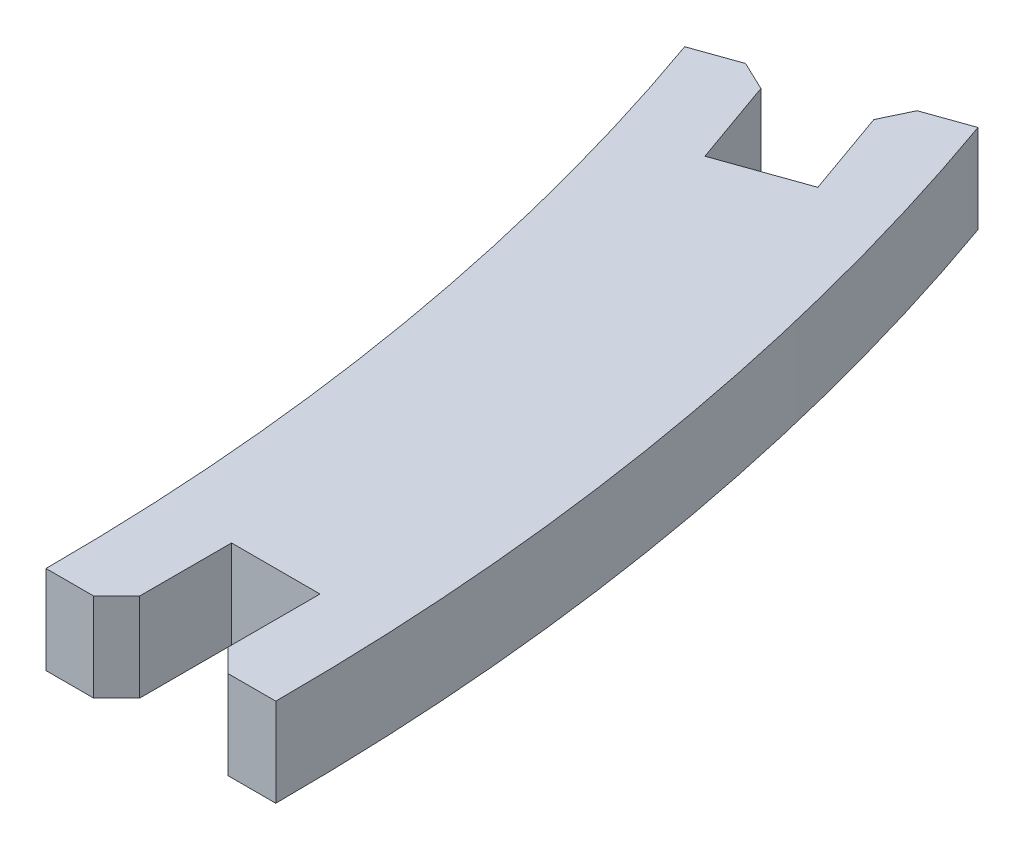
ISO-10303-21;
HEADER;
FILE_DESCRIPTION(('STEP AP214'),'2;1');
FILE_NAME('part.step','',(''),(''),'','','');
FILE_SCHEMA(('AUTOMOTIVE_DESIGN { 1 0 10303 214 1 1 1 1 }'));
ENDSEC;
DATA;
#1=APPLICATION_CONTEXT('core data for automotive mechanical design processes');
#2=APPLICATION_PROTOCOL_DEFINITION('international standard','automotive_design',2000,#1);
#3=PRODUCT_CONTEXT('',#1,'mechanical');
#4=PRODUCT('Part','Part','',(#3));
#5=PRODUCT_RELATED_PRODUCT_CATEGORY('part','',(#4));
#6=PRODUCT_DEFINITION_FORMATION('','',#4);
#7=PRODUCT_DEFINITION_CONTEXT('part definition',#1,'design');
#8=PRODUCT_DEFINITION('design','',#6,#7);
#9=PRODUCT_DEFINITION_SHAPE('','',#8);
#10=(LENGTH_UNIT() NAMED_UNIT(*) SI_UNIT(.MILLI.,.METRE.));
#11=(NAMED_UNIT(*) PLANE_ANGLE_UNIT() SI_UNIT($,.RADIAN.));
#12=(NAMED_UNIT(*) SI_UNIT($,.STERADIAN.) SOLID_ANGLE_UNIT());
#13=UNCERTAINTY_MEASURE_WITH_UNIT(LENGTH_MEASURE(1.E-05),#10,'distance_accuracy_value','');
#14=(GEOMETRIC_REPRESENTATION_CONTEXT(3) GLOBAL_UNCERTAINTY_ASSIGNED_CONTEXT((#13)) GLOBAL_UNIT_ASSIGNED_CONTEXT((#10,
#11,#12)) REPRESENTATION_CONTEXT('',''));
#15=CARTESIAN_POINT('',(0.,0.,0.));
#16=DIRECTION('',(0.,0.,1.));
#17=DIRECTION('',(1.,0.,0.));
#18=AXIS2_PLACEMENT_3D('',#15,#16,#17);
#19=CARTESIAN_POINT('',(-11.876973594274,3.85,0.165793148252615));
#20=DIRECTION('',(0.,0.,-1.));
#21=DIRECTION('',(-1.,0.,0.));
#22=AXIS2_PLACEMENT_3D('',#19,#20,#21);
#23=PLANE('',#22);
#24=DIRECTION('',(1.,0.,0.));
#25=VECTOR('',#24,1.);
#26=CARTESIAN_POINT('',(-11.876973594274,0.,0.165793148252615));
#27=LINE('',#26,#25);
#28=CARTESIAN_POINT('',(-11.876973594274,0.,0.165793148252621));
#29=VERTEX_POINT('',#28);
#30=CARTESIAN_POINT('',(-9.80197359427399,0.,0.165793148252615));
#31=VERTEX_POINT('',#30);
#32=EDGE_CURVE('E199',#29,#31,#27,.T.);
#33=ORIENTED_EDGE('',*,*,#32,.T.);
#34=DIRECTION('',(0.,1.,0.));
#35=VECTOR('',#34,1.);
#36=CARTESIAN_POINT('',(-9.80197359427399,3.85,0.165793148252615));
#37=LINE('',#36,#35);
#38=CARTESIAN_POINT('',(-9.80197359427399,3.85,0.165793148252615));
#39=VERTEX_POINT('',#38);
#40=EDGE_CURVE('E252',#31,#39,#37,.T.);
#41=ORIENTED_EDGE('',*,*,#40,.T.);
#42=DIRECTION('',(1.,0.,0.));
#43=VECTOR('',#42,1.);
#44=CARTESIAN_POINT('',(-11.876973594274,3.85,0.165793148252615));
#45=LINE('',#44,#43);
#46=CARTESIAN_POINT('',(-11.876973594274,3.85,0.165793148252621));
#47=VERTEX_POINT('',#46);
#48=EDGE_CURVE('E158',#47,#39,#45,.T.);
#49=ORIENTED_EDGE('',*,*,#48,.F.);
#50=DIRECTION('',(0.,-1.,0.));
#51=VECTOR('',#50,1.);
#52=CARTESIAN_POINT('',(-11.876973594274,3.85,0.165793148252621));
#53=LINE('',#52,#51);
#54=EDGE_CURVE('E198',#47,#29,#53,.T.);
#55=ORIENTED_EDGE('',*,*,#54,.T.);
#56=EDGE_LOOP('',(#33,#41,#49,#55));
#57=FACE_BOUND('',#56,.T.);
#58=ADVANCED_FACE('F33',(#57),#23,.F.);
#59=CARTESIAN_POINT('',(-8.80197359427398,3.85,0.165793148252615));
#60=DIRECTION('',(-1.,0.,0.));
#61=DIRECTION('',(0.,0.,1.));
#62=AXIS2_PLACEMENT_3D('',#59,#60,#61);
#63=PLANE('',#62);
#64=DIRECTION('',(0.,0.,-1.));
#65=VECTOR('',#64,1.);
#66=CARTESIAN_POINT('',(-8.80197359427398,3.85,0.165793148252615));
#67=LINE('',#66,#65);
#68=CARTESIAN_POINT('',(-8.80197359427398,3.85,-0.834206851747385));
#69=VERTEX_POINT('',#68);
#70=CARTESIAN_POINT('',(-8.80197359427398,3.85,-4.83420685174738));
#71=VERTEX_POINT('',#70);
#72=EDGE_CURVE('E146',#69,#71,#67,.T.);
#73=ORIENTED_EDGE('',*,*,#72,.F.);
#74=DIRECTION('',(0.,-1.,0.));
#75=VECTOR('',#74,1.);
#76=CARTESIAN_POINT('',(-8.80197359427398,3.85,-0.834206851747385));
#77=LINE('',#76,#75);
#78=CARTESIAN_POINT('',(-8.80197359427398,0.,-0.834206851747385));
#79=VERTEX_POINT('',#78);
#80=EDGE_CURVE('E168',#69,#79,#77,.T.);
#81=ORIENTED_EDGE('',*,*,#80,.T.);
#82=DIRECTION('',(0.,0.,-1.));
#83=VECTOR('',#82,1.);
#84=CARTESIAN_POINT('',(-8.80197359427398,0.,0.165793148252615));
#85=LINE('',#84,#83);
#86=CARTESIAN_POINT('',(-8.80197359427398,0.,-4.83420685174738));
#87=VERTEX_POINT('',#86);
#88=EDGE_CURVE('E164',#79,#87,#85,.T.);
#89=ORIENTED_EDGE('',*,*,#88,.T.);
#90=DIRECTION('',(0.,-1.,0.));
#91=VECTOR('',#90,1.);
#92=CARTESIAN_POINT('',(-8.80197359427398,3.85,-4.83420685174738));
#93=LINE('',#92,#91);
#94=EDGE_CURVE('E161',#71,#87,#93,.T.);
#95=ORIENTED_EDGE('',*,*,#94,.F.);
#96=EDGE_LOOP('',(#73,#81,#89,#95));
#97=FACE_BOUND('',#96,.T.);
#98=ADVANCED_FACE('F162',(#97),#63,.F.);
#99=CARTESIAN_POINT('',(-4.95197359427398,3.85,-4.83420685174738));
#100=DIRECTION('',(0.,0.,1.));
#101=DIRECTION('',(1.,0.,0.));
#102=AXIS2_PLACEMENT_3D('',#99,#100,#101);
#103=PLANE('',#102);
#104=DIRECTION('',(-1.,0.,0.));
#105=VECTOR('',#104,1.);
#106=CARTESIAN_POINT('',(-4.95197359427398,0.,-4.83420685174738));
#107=LINE('',#106,#105);
#108=CARTESIAN_POINT('',(-4.95197359427398,0.,-4.83420685174738));
#109=VERTEX_POINT('',#108);
#110=EDGE_CURVE('E203',#109,#87,#107,.T.);
#111=ORIENTED_EDGE('',*,*,#110,.F.);
#112=DIRECTION('',(0.,-1.,0.));
#113=VECTOR('',#112,1.);
#114=CARTESIAN_POINT('',(-4.95197359427398,3.85,-4.83420685174738));
#115=LINE('',#114,#113);
#116=CARTESIAN_POINT('',(-4.95197359427398,3.85,-4.83420685174738));
#117=VERTEX_POINT('',#116);
#118=EDGE_CURVE('E169',#117,#109,#115,.T.);
#119=ORIENTED_EDGE('',*,*,#118,.F.);
#120=DIRECTION('',(-1.,0.,0.));
#121=VECTOR('',#120,1.);
#122=CARTESIAN_POINT('',(-4.95197359427398,3.85,-4.83420685174738));
#123=LINE('',#122,#121);
#124=EDGE_CURVE('E152',#117,#71,#123,.T.);
#125=ORIENTED_EDGE('',*,*,#124,.T.);
#126=ORIENTED_EDGE('',*,*,#94,.T.);
#127=EDGE_LOOP('',(#111,#119,#125,#126));
#128=FACE_BOUND('',#127,.T.);
#129=ADVANCED_FACE('F172',(#128),#103,.T.);
#130=CARTESIAN_POINT('',(-4.95197359427398,3.85,0.165793148252615));
#131=DIRECTION('',(-1.,0.,0.));
#132=DIRECTION('',(0.,0.,1.));
#133=AXIS2_PLACEMENT_3D('',#130,#131,#132);
#134=PLANE('',#133);
#135=DIRECTION('',(0.,0.,-1.));
#136=VECTOR('',#135,1.);
#137=CARTESIAN_POINT('',(-4.95197359427398,0.,0.165793148252615));
#138=LINE('',#137,#136);
#139=CARTESIAN_POINT('',(-4.95197359427398,0.,-0.834206851747392));
#140=VERTEX_POINT('',#139);
#141=EDGE_CURVE('E205',#140,#109,#138,.T.);
#142=ORIENTED_EDGE('',*,*,#141,.F.);
#143=DIRECTION('',(0.,1.,0.));
#144=VECTOR('',#143,1.);
#145=CARTESIAN_POINT('',(-4.95197359427398,3.85,-0.834206851747392));
#146=LINE('',#145,#144);
#147=CARTESIAN_POINT('',(-4.95197359427398,3.85,-0.834206851747392));
#148=VERTEX_POINT('',#147);
#149=EDGE_CURVE('E263',#140,#148,#146,.T.);
#150=ORIENTED_EDGE('',*,*,#149,.T.);
#151=DIRECTION('',(0.,0.,-1.));
#152=VECTOR('',#151,1.);
#153=CARTESIAN_POINT('',(-4.95197359427398,3.85,0.165793148252615));
#154=LINE('',#153,#152);
#155=EDGE_CURVE('E174',#148,#117,#154,.T.);
#156=ORIENTED_EDGE('',*,*,#155,.T.);
#157=ORIENTED_EDGE('',*,*,#118,.T.);
#158=EDGE_LOOP('',(#142,#150,#156,#157));
#159=FACE_BOUND('',#158,.T.);
#160=ADVANCED_FACE('F306',(#159),#134,.T.);
#161=CARTESIAN_POINT('',(-4.95197359427398,3.85,0.165793148252615));
#162=DIRECTION('',(0.,0.,-1.));
#163=DIRECTION('',(-1.,0.,0.));
#164=AXIS2_PLACEMENT_3D('',#161,#162,#163);
#165=PLANE('',#164);
#166=DIRECTION('',(1.,0.,0.));
#167=VECTOR('',#166,1.);
#168=CARTESIAN_POINT('',(-4.95197359427398,3.85,0.165793148252615));
#169=LINE('',#168,#167);
#170=CARTESIAN_POINT('',(-3.95197359427398,3.85,0.165793148252615));
#171=VERTEX_POINT('',#170);
#172=CARTESIAN_POINT('',(-1.87697359427398,3.85,0.165793148252615));
#173=VERTEX_POINT('',#172);
#174=EDGE_CURVE('E176',#171,#173,#169,.T.);
#175=ORIENTED_EDGE('',*,*,#174,.F.);
#176=DIRECTION('',(0.,-1.,0.));
#177=VECTOR('',#176,1.);
#178=CARTESIAN_POINT('',(-3.95197359427398,0.,0.165793148252615));
#179=LINE('',#178,#177);
#180=CARTESIAN_POINT('',(-3.95197359427398,0.,0.165793148252615));
#181=VERTEX_POINT('',#180);
#182=EDGE_CURVE('E260',#171,#181,#179,.T.);
#183=ORIENTED_EDGE('',*,*,#182,.T.);
#184=DIRECTION('',(1.,0.,0.));
#185=VECTOR('',#184,1.);
#186=CARTESIAN_POINT('',(-4.95197359427398,0.,0.165793148252615));
#187=LINE('',#186,#185);
#188=CARTESIAN_POINT('',(-1.87697359427398,0.,0.165793148252615));
#189=VERTEX_POINT('',#188);
#190=EDGE_CURVE('E207',#181,#189,#187,.T.);
#191=ORIENTED_EDGE('',*,*,#190,.T.);
#192=DIRECTION('',(0.,-1.,0.));
#193=VECTOR('',#192,1.);
#194=CARTESIAN_POINT('',(-1.87697359427398,3.85,0.165793148252615));
#195=LINE('',#194,#193);
#196=EDGE_CURVE('E239',#173,#189,#195,.T.);
#197=ORIENTED_EDGE('',*,*,#196,.F.);
#198=EDGE_LOOP('',(#175,#183,#191,#197));
#199=FACE_BOUND('',#198,.T.);
#200=ADVANCED_FACE('F298',(#199),#165,.F.);
#201=CARTESIAN_POINT('',(-112.422199310062,3.85,0.165793148252615));
#202=DIRECTION('',(0.,-1.,0.));
#203=DIRECTION('',(0.,0.,-1.));
#204=AXIS2_PLACEMENT_3D('',#201,#202,#203);
#205=CYLINDRICAL_SURFACE('',#204,110.545225715788);
#206=CARTESIAN_POINT('',(-112.422199310062,0.,0.165793148252615));
#207=DIRECTION('',(0.,1.,0.));
#208=DIRECTION('',(0.,0.,1.));
#209=AXIS2_PLACEMENT_3D('',#206,#207,#208);
#210=CIRCLE('',#209,110.545225715788);
#211=CARTESIAN_POINT('',(-8.21768290821014,0.,-36.7349614512229));
#212=VERTEX_POINT('',#211);
#213=EDGE_CURVE('E209',#189,#212,#210,.T.);
#214=ORIENTED_EDGE('',*,*,#213,.T.);
#215=DIRECTION('',(0.,-1.,0.));
#216=VECTOR('',#215,1.);
#217=CARTESIAN_POINT('',(-8.21768290821014,3.85,-36.7349614512229));
#218=LINE('',#217,#216);
#219=CARTESIAN_POINT('',(-8.21768290821014,3.85,-36.7349614512229));
#220=VERTEX_POINT('',#219);
#221=EDGE_CURVE('E236',#220,#212,#218,.T.);
#222=ORIENTED_EDGE('',*,*,#221,.F.);
#223=CARTESIAN_POINT('',(-112.422199310062,3.85,0.165793148252615));
#224=DIRECTION('',(0.,1.,0.));
#225=DIRECTION('',(0.,0.,1.));
#226=AXIS2_PLACEMENT_3D('',#223,#224,#225);
#227=CIRCLE('',#226,110.545225715788);
#228=EDGE_CURVE('E181',#173,#220,#227,.T.);
#229=ORIENTED_EDGE('',*,*,#228,.F.);
#230=ORIENTED_EDGE('',*,*,#196,.T.);
#231=EDGE_LOOP('',(#214,#222,#229,#230));
#232=FACE_BOUND('',#231,.T.);
#233=ADVANCED_FACE('F293',(#232),#205,.T.);
#234=CARTESIAN_POINT('',(-11.1163054933186,3.85,-35.708505359079));
#235=DIRECTION('',(-0.333806859233771,0.,-0.942641491092179));
#236=DIRECTION('',(-0.942641491092179,0.,0.333806859233771));
#237=AXIS2_PLACEMENT_3D('',#234,#235,#236);
#238=PLANE('',#237);
#239=DIRECTION('',(0.942641491092179,0.,-0.333806859233771));
#240=VECTOR('',#239,1.);
#241=CARTESIAN_POINT('',(-11.1163054933186,0.,-35.708505359079));
#242=LINE('',#241,#240);
#243=CARTESIAN_POINT('',(-10.1736640022264,0.,-36.0423122183128));
#244=VERTEX_POINT('',#243);
#245=EDGE_CURVE('E212',#244,#212,#242,.T.);
#246=ORIENTED_EDGE('',*,*,#245,.F.);
#247=DIRECTION('',(0.,1.,0.));
#248=VECTOR('',#247,1.);
#249=CARTESIAN_POINT('',(-10.1736640022264,3.85,-36.0423122183128));
#250=LINE('',#249,#248);
#251=CARTESIAN_POINT('',(-10.1736640022264,3.85,-36.0423122183128));
#252=VERTEX_POINT('',#251);
#253=EDGE_CURVE('E11',#244,#252,#250,.T.);
#254=ORIENTED_EDGE('',*,*,#253,.T.);
#255=DIRECTION('',(0.942641491092179,0.,-0.333806859233771));
#256=VECTOR('',#255,1.);
#257=CARTESIAN_POINT('',(-11.1163054933186,3.85,-35.708505359079));
#258=LINE('',#257,#256);
#259=EDGE_CURVE('E184',#252,#220,#258,.T.);
#260=ORIENTED_EDGE('',*,*,#259,.T.);
#261=ORIENTED_EDGE('',*,*,#221,.T.);
#262=EDGE_LOOP('',(#246,#254,#260,#261));
#263=FACE_BOUND('',#262,.T.);
#264=ADVANCED_FACE('F288',(#263),#238,.T.);
#265=CARTESIAN_POINT('',(-11.1163054933186,3.85,-35.708505359079));
#266=DIRECTION('',(0.942641491092154,0.,-0.333806859233841));
#267=DIRECTION('',(-0.333806859233841,0.,-0.942641491092154));
#268=AXIS2_PLACEMENT_3D('',#265,#266,#267);
#269=PLANE('',#268);
#270=DIRECTION('',(0.333806859233841,0.,0.942641491092154));
#271=VECTOR('',#270,1.);
#272=CARTESIAN_POINT('',(-11.1163054933186,3.85,-35.708505359079));
#273=LINE('',#272,#271);
#274=CARTESIAN_POINT('',(-10.7824986340848,3.85,-34.7658638679869));
#275=VERTEX_POINT('',#274);
#276=CARTESIAN_POINT('',(-9.4472711971495,3.85,-30.9952979036185));
#277=VERTEX_POINT('',#276);
#278=EDGE_CURVE('E186',#275,#277,#273,.T.);
#279=ORIENTED_EDGE('',*,*,#278,.F.);
#280=DIRECTION('',(0.,-1.,0.));
#281=VECTOR('',#280,1.);
#282=CARTESIAN_POINT('',(-10.7824986340848,0.,-34.7658638679869));
#283=LINE('',#282,#281);
#284=CARTESIAN_POINT('',(-10.7824986340848,0.,-34.7658638679869));
#285=VERTEX_POINT('',#284);
#286=EDGE_CURVE('E41',#275,#285,#283,.T.);
#287=ORIENTED_EDGE('',*,*,#286,.T.);
#288=DIRECTION('',(0.333806859233841,0.,0.942641491092154));
#289=VECTOR('',#288,1.);
#290=CARTESIAN_POINT('',(-11.1163054933186,0.,-35.708505359079));
#291=LINE('',#290,#289);
#292=CARTESIAN_POINT('',(-9.4472711971495,0.,-30.9952979036185));
#293=VERTEX_POINT('',#292);
#294=EDGE_CURVE('E214',#285,#293,#291,.T.);
#295=ORIENTED_EDGE('',*,*,#294,.T.);
#296=DIRECTION('',(0.,-1.,0.));
#297=VECTOR('',#296,1.);
#298=CARTESIAN_POINT('',(-9.4472711971495,3.85,-30.9952979036185));
#299=LINE('',#298,#297);
#300=EDGE_CURVE('E233',#277,#293,#299,.T.);
#301=ORIENTED_EDGE('',*,*,#300,.F.);
#302=EDGE_LOOP('',(#279,#287,#295,#301));
#303=FACE_BOUND('',#302,.T.);
#304=ADVANCED_FACE('F273',(#303),#269,.F.);
#305=CARTESIAN_POINT('',(-9.4472711971495,3.85,-30.9952979036185));
#306=DIRECTION('',(0.333806859233844,0.,0.942641491092153));
#307=DIRECTION('',(0.942641491092153,0.,-0.333806859233844));
#308=AXIS2_PLACEMENT_3D('',#305,#306,#307);
#309=PLANE('',#308);
#310=DIRECTION('',(-0.942641491092153,0.,0.333806859233844));
#311=VECTOR('',#310,1.);
#312=CARTESIAN_POINT('',(-9.4472711971495,0.,-30.9952979036185));
#313=LINE('',#312,#311);
#314=CARTESIAN_POINT('',(-13.0764409378543,0.,-29.7101414955682));
#315=VERTEX_POINT('',#314);
#316=EDGE_CURVE('E216',#293,#315,#313,.T.);
#317=ORIENTED_EDGE('',*,*,#316,.T.);
#318=DIRECTION('',(0.,-1.,0.));
#319=VECTOR('',#318,1.);
#320=CARTESIAN_POINT('',(-13.0764409378543,3.85,-29.7101414955682));
#321=LINE('',#320,#319);
#322=CARTESIAN_POINT('',(-13.0764409378543,3.85,-29.7101414955682));
#323=VERTEX_POINT('',#322);
#324=EDGE_CURVE('E230',#323,#315,#321,.T.);
#325=ORIENTED_EDGE('',*,*,#324,.F.);
#326=DIRECTION('',(-0.942641491092153,0.,0.333806859233844));
#327=VECTOR('',#326,1.);
#328=CARTESIAN_POINT('',(-9.4472711971495,3.85,-30.9952979036185));
#329=LINE('',#328,#327);
#330=EDGE_CURVE('E188',#277,#323,#329,.T.);
#331=ORIENTED_EDGE('',*,*,#330,.F.);
#332=ORIENTED_EDGE('',*,*,#300,.T.);
#333=EDGE_LOOP('',(#317,#325,#331,#332));
#334=FACE_BOUND('',#333,.T.);
#335=ADVANCED_FACE('F283',(#334),#309,.F.);
#336=CARTESIAN_POINT('',(-14.7454752340235,3.85,-34.423348951029));
#337=DIRECTION('',(0.942641491092153,0.,-0.333806859233842));
#338=DIRECTION('',(-0.333806859233842,0.,-0.942641491092153));
#339=AXIS2_PLACEMENT_3D('',#336,#337,#338);
#340=PLANE('',#339);
#341=DIRECTION('',(0.333806859233842,0.,0.942641491092153));
#342=VECTOR('',#341,1.);
#343=CARTESIAN_POINT('',(-14.7454752340235,0.,-34.423348951029));
#344=LINE('',#343,#342);
#345=CARTESIAN_POINT('',(-14.4116683747897,0.,-33.4807074599369));
#346=VERTEX_POINT('',#345);
#347=EDGE_CURVE('E219',#346,#315,#344,.T.);
#348=ORIENTED_EDGE('',*,*,#347,.F.);
#349=DIRECTION('',(0.,1.,0.));
#350=VECTOR('',#349,1.);
#351=CARTESIAN_POINT('',(-14.4116683747897,3.85,-33.4807074599369));
#352=LINE('',#351,#350);
#353=CARTESIAN_POINT('',(-14.4116683747897,3.85,-33.4807074599369));
#354=VERTEX_POINT('',#353);
#355=EDGE_CURVE('E56',#346,#354,#352,.T.);
#356=ORIENTED_EDGE('',*,*,#355,.T.);
#357=DIRECTION('',(0.333806859233842,0.,0.942641491092153));
#358=VECTOR('',#357,1.);
#359=CARTESIAN_POINT('',(-14.7454752340235,3.85,-34.423348951029));
#360=LINE('',#359,#358);
#361=EDGE_CURVE('E191',#354,#323,#360,.T.);
#362=ORIENTED_EDGE('',*,*,#361,.T.);
#363=ORIENTED_EDGE('',*,*,#324,.T.);
#364=EDGE_LOOP('',(#348,#356,#362,#363));
#365=FACE_BOUND('',#364,.T.);
#366=ADVANCED_FACE('F344',(#365),#340,.T.);
#367=CARTESIAN_POINT('',(-17.6440978191319,3.85,-33.3968928588852));
#368=DIRECTION('',(-0.33380685923377,0.,-0.942641491092179));
#369=DIRECTION('',(-0.942641491092179,0.,0.33380685923377));
#370=AXIS2_PLACEMENT_3D('',#367,#368,#369);
#371=PLANE('',#370);
#372=DIRECTION('',(0.942641491092179,0.,-0.33380685923377));
#373=VECTOR('',#372,1.);
#374=CARTESIAN_POINT('',(-17.6440978191319,3.85,-33.3968928588852));
#375=LINE('',#374,#373);
#376=CARTESIAN_POINT('',(-17.6440978191319,3.85,-33.3968928588852));
#377=VERTEX_POINT('',#376);
#378=CARTESIAN_POINT('',(-15.6881167251157,3.85,-34.0895420917952));
#379=VERTEX_POINT('',#378);
#380=EDGE_CURVE('E193',#377,#379,#375,.T.);
#381=ORIENTED_EDGE('',*,*,#380,.T.);
#382=DIRECTION('',(0.,-1.,0.));
#383=VECTOR('',#382,1.);
#384=CARTESIAN_POINT('',(-15.6881167251157,3.85,-34.0895420917952));
#385=LINE('',#384,#383);
#386=CARTESIAN_POINT('',(-15.6881167251157,0.,-34.0895420917952));
#387=VERTEX_POINT('',#386);
#388=EDGE_CURVE('E265',#379,#387,#385,.T.);
#389=ORIENTED_EDGE('',*,*,#388,.T.);
#390=DIRECTION('',(0.942641491092179,0.,-0.33380685923377));
#391=VECTOR('',#390,1.);
#392=CARTESIAN_POINT('',(-17.6440978191319,0.,-33.3968928588852));
#393=LINE('',#392,#391);
#394=CARTESIAN_POINT('',(-17.6440978191319,0.,-33.3968928588852));
#395=VERTEX_POINT('',#394);
#396=EDGE_CURVE('E221',#395,#387,#393,.T.);
#397=ORIENTED_EDGE('',*,*,#396,.F.);
#398=DIRECTION('',(0.,-1.,0.));
#399=VECTOR('',#398,1.);
#400=CARTESIAN_POINT('',(-17.6440978191319,3.85,-33.3968928588852));
#401=LINE('',#400,#399);
#402=EDGE_CURVE('E228',#377,#395,#401,.T.);
#403=ORIENTED_EDGE('',*,*,#402,.F.);
#404=EDGE_LOOP('',(#381,#389,#397,#403));
#405=FACE_BOUND('',#404,.T.);
#406=ADVANCED_FACE('F347',(#405),#371,.T.);
#407=CARTESIAN_POINT('',(-112.422199310062,3.85,0.165793148252615));
#408=DIRECTION('',(0.,-1.,0.));
#409=DIRECTION('',(0.,0.,-1.));
#410=AXIS2_PLACEMENT_3D('',#407,#408,#409);
#411=CYLINDRICAL_SURFACE('',#410,100.545225715788);
#412=CARTESIAN_POINT('',(-112.422199310062,0.,0.165793148252615));
#413=DIRECTION('',(0.,1.,0.));
#414=DIRECTION('',(0.,0.,1.));
#415=AXIS2_PLACEMENT_3D('',#412,#413,#414);
#416=CIRCLE('',#415,100.545225715788);
#417=EDGE_CURVE('E224',#29,#395,#416,.T.);
#418=ORIENTED_EDGE('',*,*,#417,.F.);
#419=ORIENTED_EDGE('',*,*,#54,.F.);
#420=CARTESIAN_POINT('',(-112.422199310062,3.85,0.165793148252615));
#421=DIRECTION('',(0.,1.,0.));
#422=DIRECTION('',(0.,0.,1.));
#423=AXIS2_PLACEMENT_3D('',#420,#421,#422);
#424=CIRCLE('',#423,100.545225715788);
#425=EDGE_CURVE('E195',#47,#377,#424,.T.);
#426=ORIENTED_EDGE('',*,*,#425,.T.);
#427=ORIENTED_EDGE('',*,*,#402,.T.);
#428=EDGE_LOOP('',(#418,#419,#426,#427));
#429=FACE_BOUND('',#428,.T.);
#430=ADVANCED_FACE('F350',(#429),#411,.F.);
#431=CARTESIAN_POINT('',(-112.422199310062,3.85,0.165793148252615));
#432=DIRECTION('',(0.,1.,0.));
#433=DIRECTION('',(0.,0.,1.));
#434=AXIS2_PLACEMENT_3D('',#431,#432,#433);
#435=PLANE('',#434);
#436=ORIENTED_EDGE('',*,*,#48,.T.);
#437=DIRECTION('',(-0.707106781186549,0.,0.707106781186546));
#438=VECTOR('',#437,1.);
#439=CARTESIAN_POINT('',(-61.1120864521684,3.85,51.4759060061468));
#440=LINE('',#439,#438);
#441=EDGE_CURVE('E154',#39,#69,#440,.F.);
#442=ORIENTED_EDGE('',*,*,#441,.T.);
#443=ORIENTED_EDGE('',*,*,#72,.T.);
#444=ORIENTED_EDGE('',*,*,#124,.F.);
#445=ORIENTED_EDGE('',*,*,#155,.F.);
#446=DIRECTION('',(0.707106781186547,0.,0.707106781186548));
#447=VECTOR('',#446,1.);
#448=CARTESIAN_POINT('',(-58.187086452168,3.85,-54.0693197096416));
#449=LINE('',#448,#447);
#450=EDGE_CURVE('E257',#148,#171,#449,.T.);
#451=ORIENTED_EDGE('',*,*,#450,.T.);
#452=ORIENTED_EDGE('',*,*,#174,.T.);
#453=ORIENTED_EDGE('',*,*,#228,.T.);
#454=ORIENTED_EDGE('',*,*,#259,.F.);
#455=DIRECTION('',(-0.4305110968083,0.,0.902585284349858));
#456=VECTOR('',#455,1.);
#457=CARTESIAN_POINT('',(-43.1938789728621,3.85,33.186008118888));
#458=LINE('',#457,#456);
#459=EDGE_CURVE('E254',#252,#275,#458,.T.);
#460=ORIENTED_EDGE('',*,*,#459,.T.);
#461=ORIENTED_EDGE('',*,*,#278,.T.);
#462=ORIENTED_EDGE('',*,*,#330,.T.);
#463=ORIENTED_EDGE('',*,*,#361,.F.);
#464=DIRECTION('',(0.902585284349893,0.,0.430511096808229));
#465=VECTOR('',#464,1.);
#466=CARTESIAN_POINT('',(-81.1828256376202,3.85,-65.328915764242));
#467=LINE('',#466,#465);
#468=EDGE_CURVE('E48',#354,#379,#467,.F.);
#469=ORIENTED_EDGE('',*,*,#468,.T.);
#470=ORIENTED_EDGE('',*,*,#380,.F.);
#471=ORIENTED_EDGE('',*,*,#425,.F.);
#472=EDGE_LOOP('',(#436,#442,#443,#444,#445,#451,#452,#453,#454,#460,#461,#462,#463,#469,#470,#471));
#473=FACE_BOUND('',#472,.T.);
#474=ADVANCED_FACE('F149',(#473),#435,.T.);
#475=CARTESIAN_POINT('',(-112.422199310062,0.,0.165793148252615));
#476=DIRECTION('',(0.,1.,0.));
#477=DIRECTION('',(0.,0.,1.));
#478=AXIS2_PLACEMENT_3D('',#475,#476,#477);
#479=PLANE('',#478);
#480=ORIENTED_EDGE('',*,*,#88,.F.);
#481=DIRECTION('',(0.707106781186549,0.,-0.707106781186546));
#482=VECTOR('',#481,1.);
#483=CARTESIAN_POINT('',(-8.80197359427398,0.,-0.834206851747385));
#484=LINE('',#483,#482);
#485=EDGE_CURVE('E250',#79,#31,#484,.F.);
#486=ORIENTED_EDGE('',*,*,#485,.T.);
#487=ORIENTED_EDGE('',*,*,#32,.F.);
#488=ORIENTED_EDGE('',*,*,#417,.T.);
#489=ORIENTED_EDGE('',*,*,#396,.T.);
#490=DIRECTION('',(-0.902585284349893,0.,-0.430511096808229));
#491=VECTOR('',#490,1.);
#492=CARTESIAN_POINT('',(-15.6881167251157,0.,-34.0895420917952));
#493=LINE('',#492,#491);
#494=EDGE_CURVE('E246',#387,#346,#493,.F.);
#495=ORIENTED_EDGE('',*,*,#494,.T.);
#496=ORIENTED_EDGE('',*,*,#347,.T.);
#497=ORIENTED_EDGE('',*,*,#316,.F.);
#498=ORIENTED_EDGE('',*,*,#294,.F.);
#499=DIRECTION('',(0.4305110968083,0.,-0.902585284349858));
#500=VECTOR('',#499,1.);
#501=CARTESIAN_POINT('',(-10.7824986340848,0.,-34.7658638679869));
#502=LINE('',#501,#500);
#503=EDGE_CURVE('E244',#285,#244,#502,.T.);
#504=ORIENTED_EDGE('',*,*,#503,.T.);
#505=ORIENTED_EDGE('',*,*,#245,.T.);
#506=ORIENTED_EDGE('',*,*,#213,.F.);
#507=ORIENTED_EDGE('',*,*,#190,.F.);
#508=DIRECTION('',(-0.707106781186547,0.,-0.707106781186548));
#509=VECTOR('',#508,1.);
#510=CARTESIAN_POINT('',(-3.95197359427398,0.,0.165793148252615));
#511=LINE('',#510,#509);
#512=EDGE_CURVE('E248',#181,#140,#511,.T.);
#513=ORIENTED_EDGE('',*,*,#512,.T.);
#514=ORIENTED_EDGE('',*,*,#141,.T.);
#515=ORIENTED_EDGE('',*,*,#110,.T.);
#516=EDGE_LOOP('',(#480,#486,#487,#488,#489,#495,#496,#497,#498,#504,#505,#506,#507,#513,#514,#515));
#517=FACE_BOUND('',#516,.T.);
#518=ADVANCED_FACE('F279',(#517),#479,.F.);
#519=CARTESIAN_POINT('',(-8.80197359427398,3.85,-0.834206851747385));
#520=DIRECTION('',(-0.707106781186546,0.,-0.707106781186549));
#521=DIRECTION('',(0.,-1.,0.));
#522=AXIS2_PLACEMENT_3D('',#519,#520,#521);
#523=PLANE('',#522);
#524=ORIENTED_EDGE('',*,*,#441,.F.);
#525=ORIENTED_EDGE('',*,*,#40,.F.);
#526=ORIENTED_EDGE('',*,*,#485,.F.);
#527=ORIENTED_EDGE('',*,*,#80,.F.);
#528=EDGE_LOOP('',(#524,#525,#526,#527));
#529=FACE_BOUND('',#528,.T.);
#530=ADVANCED_FACE('F313',(#529),#523,.F.);
#531=CARTESIAN_POINT('',(-3.95197359427398,3.85,0.165793148252615));
#532=DIRECTION('',(-0.707106781186548,0.,0.707106781186547));
#533=DIRECTION('',(0.,1.,0.));
#534=AXIS2_PLACEMENT_3D('',#531,#532,#533);
#535=PLANE('',#534);
#536=ORIENTED_EDGE('',*,*,#450,.F.);
#537=ORIENTED_EDGE('',*,*,#149,.F.);
#538=ORIENTED_EDGE('',*,*,#512,.F.);
#539=ORIENTED_EDGE('',*,*,#182,.F.);
#540=EDGE_LOOP('',(#536,#537,#538,#539));
#541=FACE_BOUND('',#540,.T.);
#542=ADVANCED_FACE('F302',(#541),#535,.T.);
#543=CARTESIAN_POINT('',(-15.6881167251157,3.85,-34.0895420917952));
#544=DIRECTION('',(-0.430511096808228,0.,0.902585284349892));
#545=DIRECTION('',(0.,-1.,0.));
#546=AXIS2_PLACEMENT_3D('',#543,#544,#545);
#547=PLANE('',#546);
#548=ORIENTED_EDGE('',*,*,#468,.F.);
#549=ORIENTED_EDGE('',*,*,#355,.F.);
#550=ORIENTED_EDGE('',*,*,#494,.F.);
#551=ORIENTED_EDGE('',*,*,#388,.F.);
#552=EDGE_LOOP('',(#548,#549,#550,#551));
#553=FACE_BOUND('',#552,.T.);
#554=ADVANCED_FACE('F320',(#553),#547,.F.);
#555=CARTESIAN_POINT('',(-10.7824986340848,3.85,-34.7658638679869));
#556=DIRECTION('',(-0.902585284349858,0.,-0.4305110968083));
#557=DIRECTION('',(0.,1.,0.));
#558=AXIS2_PLACEMENT_3D('',#555,#556,#557);
#559=PLANE('',#558);
#560=ORIENTED_EDGE('',*,*,#459,.F.);
#561=ORIENTED_EDGE('',*,*,#253,.F.);
#562=ORIENTED_EDGE('',*,*,#503,.F.);
#563=ORIENTED_EDGE('',*,*,#286,.F.);
#564=EDGE_LOOP('',(#560,#561,#562,#563));
#565=FACE_BOUND('',#564,.T.);
#566=ADVANCED_FACE('F35',(#565),#559,.T.);
#567=CLOSED_SHELL('',(#58,#98,#129,#160,#200,#233,#264,#304,#335,#366,#406,#430,#474,#518,#530,
#542,#554,#566));
#568=MANIFOLD_SOLID_BREP('B2',#567);
#569=ADVANCED_BREP_SHAPE_REPRESENTATION('',(#18,#568),#14);
#570=SHAPE_DEFINITION_REPRESENTATION(#9,#569);
ENDSEC;
END-ISO-10303-21;
